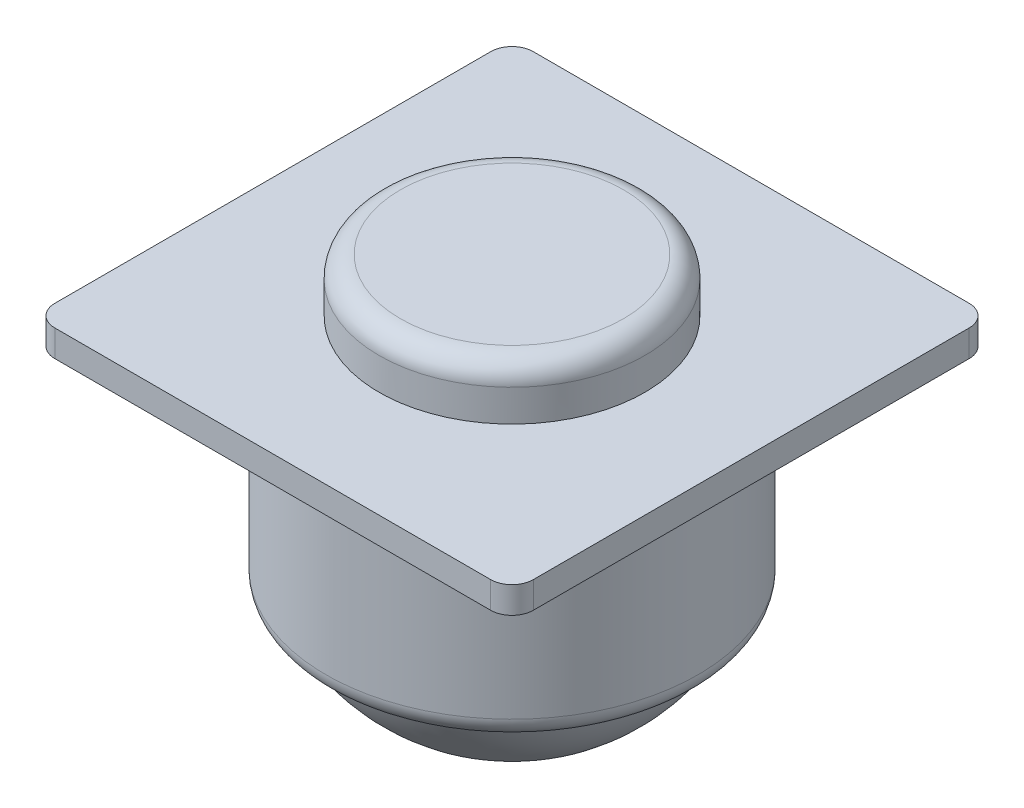
ISO-10303-21;
HEADER;
FILE_DESCRIPTION(('STEP AP214'),'2;1');
FILE_NAME('part.step','',(''),(''),'','','');
FILE_SCHEMA(('AUTOMOTIVE_DESIGN { 1 0 10303 214 1 1 1 1 }'));
ENDSEC;
DATA;
#1=APPLICATION_CONTEXT('core data for automotive mechanical design processes');
#2=APPLICATION_PROTOCOL_DEFINITION('international standard','automotive_design',2000,#1);
#3=PRODUCT_CONTEXT('',#1,'mechanical');
#4=PRODUCT('Part','Part','',(#3));
#5=PRODUCT_RELATED_PRODUCT_CATEGORY('part','',(#4));
#6=PRODUCT_DEFINITION_FORMATION('','',#4);
#7=PRODUCT_DEFINITION_CONTEXT('part definition',#1,'design');
#8=PRODUCT_DEFINITION('design','',#6,#7);
#9=PRODUCT_DEFINITION_SHAPE('','',#8);
#10=(LENGTH_UNIT() NAMED_UNIT(*) SI_UNIT(.MILLI.,.METRE.));
#11=(NAMED_UNIT(*) PLANE_ANGLE_UNIT() SI_UNIT($,.RADIAN.));
#12=(NAMED_UNIT(*) SI_UNIT($,.STERADIAN.) SOLID_ANGLE_UNIT());
#13=UNCERTAINTY_MEASURE_WITH_UNIT(LENGTH_MEASURE(1.E-05),#10,'distance_accuracy_value','');
#14=(GEOMETRIC_REPRESENTATION_CONTEXT(3) GLOBAL_UNCERTAINTY_ASSIGNED_CONTEXT((#13)) GLOBAL_UNIT_ASSIGNED_CONTEXT((#10,
#11,#12)) REPRESENTATION_CONTEXT('',''));
#15=CARTESIAN_POINT('',(0.,0.,0.));
#16=DIRECTION('',(0.,0.,1.));
#17=DIRECTION('',(1.,0.,0.));
#18=AXIS2_PLACEMENT_3D('',#15,#16,#17);
#19=CARTESIAN_POINT('',(14.2875,0.,-14.2875));
#20=DIRECTION('',(0.,-1.,0.));
#21=DIRECTION('',(0.,0.,-1.));
#22=AXIS2_PLACEMENT_3D('',#19,#20,#21);
#23=PLANE('',#22);
#24=DIRECTION('',(0.,0.,1.));
#25=VECTOR('',#24,1.);
#26=CARTESIAN_POINT('',(-14.2875,0.,14.2875));
#27=LINE('',#26,#25);
#28=CARTESIAN_POINT('',(-14.2875,0.,-13.0175));
#29=VERTEX_POINT('',#28);
#30=CARTESIAN_POINT('',(-14.2875,0.,13.0175));
#31=VERTEX_POINT('',#30);
#32=EDGE_CURVE('E115',#29,#31,#27,.T.);
#33=ORIENTED_EDGE('',*,*,#32,.F.);
#34=CARTESIAN_POINT('',(-13.0175,0.,-13.0175));
#35=DIRECTION('',(0.,-1.,0.));
#36=DIRECTION('',(0.,0.,-1.));
#37=AXIS2_PLACEMENT_3D('',#34,#35,#36);
#38=CIRCLE('',#37,1.27);
#39=CARTESIAN_POINT('',(-13.0175,0.,-14.2875));
#40=VERTEX_POINT('',#39);
#41=EDGE_CURVE('E98',#29,#40,#38,.T.);
#42=ORIENTED_EDGE('',*,*,#41,.T.);
#43=DIRECTION('',(-1.,0.,0.));
#44=VECTOR('',#43,1.);
#45=CARTESIAN_POINT('',(-14.2875,0.,-14.2875));
#46=LINE('',#45,#44);
#47=CARTESIAN_POINT('',(13.0175,0.,-14.2875));
#48=VERTEX_POINT('',#47);
#49=EDGE_CURVE('E124',#48,#40,#46,.T.);
#50=ORIENTED_EDGE('',*,*,#49,.F.);
#51=CARTESIAN_POINT('',(13.0175,0.,-13.0175));
#52=DIRECTION('',(0.,-1.,0.));
#53=DIRECTION('',(0.,0.,-1.));
#54=AXIS2_PLACEMENT_3D('',#51,#52,#53);
#55=CIRCLE('',#54,1.27);
#56=CARTESIAN_POINT('',(14.2875,0.,-13.0175));
#57=VERTEX_POINT('',#56);
#58=EDGE_CURVE('E109',#48,#57,#55,.T.);
#59=ORIENTED_EDGE('',*,*,#58,.T.);
#60=DIRECTION('',(0.,0.,-1.));
#61=VECTOR('',#60,1.);
#62=CARTESIAN_POINT('',(14.2875,0.,14.2875));
#63=LINE('',#62,#61);
#64=CARTESIAN_POINT('',(14.2875,0.,13.0175));
#65=VERTEX_POINT('',#64);
#66=EDGE_CURVE('E128',#65,#57,#63,.T.);
#67=ORIENTED_EDGE('',*,*,#66,.F.);
#68=CARTESIAN_POINT('',(13.0175,0.,13.0175));
#69=DIRECTION('',(0.,-1.,0.));
#70=DIRECTION('',(0.,0.,-1.));
#71=AXIS2_PLACEMENT_3D('',#68,#69,#70);
#72=CIRCLE('',#71,1.27);
#73=CARTESIAN_POINT('',(13.0175,0.,14.2875));
#74=VERTEX_POINT('',#73);
#75=EDGE_CURVE('E150',#65,#74,#72,.T.);
#76=ORIENTED_EDGE('',*,*,#75,.T.);
#77=DIRECTION('',(1.,0.,0.));
#78=VECTOR('',#77,1.);
#79=CARTESIAN_POINT('',(-14.2875,0.,14.2875));
#80=LINE('',#79,#78);
#81=CARTESIAN_POINT('',(-13.0175,0.,14.2875));
#82=VERTEX_POINT('',#81);
#83=EDGE_CURVE('E123',#82,#74,#80,.T.);
#84=ORIENTED_EDGE('',*,*,#83,.F.);
#85=CARTESIAN_POINT('',(-13.0175,0.,13.0175));
#86=DIRECTION('',(0.,-1.,0.));
#87=DIRECTION('',(0.,0.,-1.));
#88=AXIS2_PLACEMENT_3D('',#85,#86,#87);
#89=CIRCLE('',#88,1.27);
#90=EDGE_CURVE('E118',#82,#31,#89,.T.);
#91=ORIENTED_EDGE('',*,*,#90,.T.);
#92=EDGE_LOOP('',(#33,#42,#50,#59,#67,#76,#84,#91));
#93=FACE_BOUND('',#92,.T.);
#94=CARTESIAN_POINT('',(0.,0.,0.));
#95=DIRECTION('',(0.,-1.,0.));
#96=DIRECTION('',(0.,0.,-1.));
#97=AXIS2_PLACEMENT_3D('',#94,#95,#96);
#98=CIRCLE('',#97,11.1125);
#99=CARTESIAN_POINT('',(0.,0.,-11.1125));
#100=VERTEX_POINT('',#99);
#101=EDGE_CURVE('E188',#100,#100,#98,.T.);
#102=ORIENTED_EDGE('',*,*,#101,.F.);
#103=EDGE_LOOP('',(#102));
#104=FACE_BOUND('',#103,.T.);
#105=ADVANCED_FACE('F33',(#93,#104),#23,.T.);
#106=CARTESIAN_POINT('',(14.2875,1.5875,-14.2875));
#107=DIRECTION('',(0.,-1.,0.));
#108=DIRECTION('',(0.,0.,-1.));
#109=AXIS2_PLACEMENT_3D('',#106,#107,#108);
#110=PLANE('',#109);
#111=DIRECTION('',(-1.,0.,0.));
#112=VECTOR('',#111,1.);
#113=CARTESIAN_POINT('',(-14.2875,1.5875,-14.2875));
#114=LINE('',#113,#112);
#115=CARTESIAN_POINT('',(13.0175,1.5875,-14.2875));
#116=VERTEX_POINT('',#115);
#117=CARTESIAN_POINT('',(-13.0175,1.5875,-14.2875));
#118=VERTEX_POINT('',#117);
#119=EDGE_CURVE('E183',#116,#118,#114,.T.);
#120=ORIENTED_EDGE('',*,*,#119,.T.);
#121=CARTESIAN_POINT('',(-13.0175,1.5875,-13.0175));
#122=DIRECTION('',(0.,-1.,0.));
#123=DIRECTION('',(0.,0.,-1.));
#124=AXIS2_PLACEMENT_3D('',#121,#122,#123);
#125=CIRCLE('',#124,1.27);
#126=CARTESIAN_POINT('',(-14.2875,1.5875,-13.0175));
#127=VERTEX_POINT('',#126);
#128=EDGE_CURVE('E161',#118,#127,#125,.F.);
#129=ORIENTED_EDGE('',*,*,#128,.T.);
#130=DIRECTION('',(0.,0.,1.));
#131=VECTOR('',#130,1.);
#132=CARTESIAN_POINT('',(-14.2875,1.5875,14.2875));
#133=LINE('',#132,#131);
#134=CARTESIAN_POINT('',(-14.2875,1.5875,13.0175));
#135=VERTEX_POINT('',#134);
#136=EDGE_CURVE('E117',#127,#135,#133,.T.);
#137=ORIENTED_EDGE('',*,*,#136,.T.);
#138=CARTESIAN_POINT('',(-13.0175,1.5875,13.0175));
#139=DIRECTION('',(0.,-1.,0.));
#140=DIRECTION('',(0.,0.,-1.));
#141=AXIS2_PLACEMENT_3D('',#138,#139,#140);
#142=CIRCLE('',#141,1.27);
#143=CARTESIAN_POINT('',(-13.0175,1.5875,14.2875));
#144=VERTEX_POINT('',#143);
#145=EDGE_CURVE('E53',#135,#144,#142,.F.);
#146=ORIENTED_EDGE('',*,*,#145,.T.);
#147=DIRECTION('',(1.,0.,0.));
#148=VECTOR('',#147,1.);
#149=CARTESIAN_POINT('',(-14.2875,1.5875,14.2875));
#150=LINE('',#149,#148);
#151=CARTESIAN_POINT('',(13.0175,1.5875,14.2875));
#152=VERTEX_POINT('',#151);
#153=EDGE_CURVE('E136',#144,#152,#150,.T.);
#154=ORIENTED_EDGE('',*,*,#153,.T.);
#155=CARTESIAN_POINT('',(13.0175,1.5875,13.0175));
#156=DIRECTION('',(0.,-1.,0.));
#157=DIRECTION('',(0.,0.,-1.));
#158=AXIS2_PLACEMENT_3D('',#155,#156,#157);
#159=CIRCLE('',#158,1.27);
#160=CARTESIAN_POINT('',(14.2875,1.5875,13.0175));
#161=VERTEX_POINT('',#160);
#162=EDGE_CURVE('E157',#152,#161,#159,.F.);
#163=ORIENTED_EDGE('',*,*,#162,.T.);
#164=DIRECTION('',(0.,0.,-1.));
#165=VECTOR('',#164,1.);
#166=CARTESIAN_POINT('',(14.2875,1.5875,14.2875));
#167=LINE('',#166,#165);
#168=CARTESIAN_POINT('',(14.2875,1.5875,-13.0175));
#169=VERTEX_POINT('',#168);
#170=EDGE_CURVE('E126',#161,#169,#167,.T.);
#171=ORIENTED_EDGE('',*,*,#170,.T.);
#172=CARTESIAN_POINT('',(13.0175,1.5875,-13.0175));
#173=DIRECTION('',(0.,-1.,0.));
#174=DIRECTION('',(0.,0.,-1.));
#175=AXIS2_PLACEMENT_3D('',#172,#173,#174);
#176=CIRCLE('',#175,1.27);
#177=EDGE_CURVE('E159',#169,#116,#176,.F.);
#178=ORIENTED_EDGE('',*,*,#177,.T.);
#179=EDGE_LOOP('',(#120,#129,#137,#146,#154,#163,#171,#178));
#180=FACE_BOUND('',#179,.T.);
#181=CARTESIAN_POINT('',(0.,1.5875,0.));
#182=DIRECTION('',(0.,-1.,0.));
#183=DIRECTION('',(0.,0.,-1.));
#184=AXIS2_PLACEMENT_3D('',#181,#182,#183);
#185=CIRCLE('',#184,7.9375);
#186=CARTESIAN_POINT('',(0.,1.5875,-7.9375));
#187=VERTEX_POINT('',#186);
#188=EDGE_CURVE('E132',#187,#187,#185,.F.);
#189=ORIENTED_EDGE('',*,*,#188,.F.);
#190=EDGE_LOOP('',(#189));
#191=FACE_BOUND('',#190,.T.);
#192=ADVANCED_FACE('F196',(#180,#191),#110,.F.);
#193=CARTESIAN_POINT('',(14.2875,1.5875,14.2875));
#194=DIRECTION('',(-1.,0.,0.));
#195=DIRECTION('',(0.,0.,1.));
#196=AXIS2_PLACEMENT_3D('',#193,#194,#195);
#197=PLANE('',#196);
#198=ORIENTED_EDGE('',*,*,#66,.T.);
#199=DIRECTION('',(0.,-1.,0.));
#200=VECTOR('',#199,1.);
#201=CARTESIAN_POINT('',(14.2875,1.5875,-13.0175));
#202=LINE('',#201,#200);
#203=EDGE_CURVE('E166',#57,#169,#202,.F.);
#204=ORIENTED_EDGE('',*,*,#203,.T.);
#205=ORIENTED_EDGE('',*,*,#170,.F.);
#206=DIRECTION('',(0.,-1.,0.));
#207=VECTOR('',#206,1.);
#208=CARTESIAN_POINT('',(14.2875,1.5875,13.0175));
#209=LINE('',#208,#207);
#210=EDGE_CURVE('E163',#161,#65,#209,.T.);
#211=ORIENTED_EDGE('',*,*,#210,.T.);
#212=EDGE_LOOP('',(#198,#204,#205,#211));
#213=FACE_BOUND('',#212,.T.);
#214=ADVANCED_FACE('F179',(#213),#197,.F.);
#215=CARTESIAN_POINT('',(-14.2875,1.5875,-14.2875));
#216=DIRECTION('',(0.,0.,1.));
#217=DIRECTION('',(1.,0.,0.));
#218=AXIS2_PLACEMENT_3D('',#215,#216,#217);
#219=PLANE('',#218);
#220=ORIENTED_EDGE('',*,*,#49,.T.);
#221=DIRECTION('',(0.,-1.,0.));
#222=VECTOR('',#221,1.);
#223=CARTESIAN_POINT('',(-13.0175,1.5875,-14.2875));
#224=LINE('',#223,#222);
#225=EDGE_CURVE('E103',#40,#118,#224,.F.);
#226=ORIENTED_EDGE('',*,*,#225,.T.);
#227=ORIENTED_EDGE('',*,*,#119,.F.);
#228=DIRECTION('',(0.,-1.,0.));
#229=VECTOR('',#228,1.);
#230=CARTESIAN_POINT('',(13.0175,1.5875,-14.2875));
#231=LINE('',#230,#229);
#232=EDGE_CURVE('E108',#116,#48,#231,.T.);
#233=ORIENTED_EDGE('',*,*,#232,.T.);
#234=EDGE_LOOP('',(#220,#226,#227,#233));
#235=FACE_BOUND('',#234,.T.);
#236=ADVANCED_FACE('F209',(#235),#219,.F.);
#237=CARTESIAN_POINT('',(-14.2875,1.5875,14.2875));
#238=DIRECTION('',(1.,0.,0.));
#239=DIRECTION('',(0.,0.,-1.));
#240=AXIS2_PLACEMENT_3D('',#237,#238,#239);
#241=PLANE('',#240);
#242=ORIENTED_EDGE('',*,*,#136,.F.);
#243=DIRECTION('',(0.,-1.,0.));
#244=VECTOR('',#243,1.);
#245=CARTESIAN_POINT('',(-14.2875,1.5875,-13.0175));
#246=LINE('',#245,#244);
#247=EDGE_CURVE('E102',#127,#29,#246,.T.);
#248=ORIENTED_EDGE('',*,*,#247,.T.);
#249=ORIENTED_EDGE('',*,*,#32,.T.);
#250=DIRECTION('',(0.,-1.,0.));
#251=VECTOR('',#250,1.);
#252=CARTESIAN_POINT('',(-14.2875,1.5875,13.0175));
#253=LINE('',#252,#251);
#254=EDGE_CURVE('E119',#31,#135,#253,.F.);
#255=ORIENTED_EDGE('',*,*,#254,.T.);
#256=EDGE_LOOP('',(#242,#248,#249,#255));
#257=FACE_BOUND('',#256,.T.);
#258=ADVANCED_FACE('F114',(#257),#241,.F.);
#259=CARTESIAN_POINT('',(-14.2875,1.5875,14.2875));
#260=DIRECTION('',(0.,0.,-1.));
#261=DIRECTION('',(-1.,0.,0.));
#262=AXIS2_PLACEMENT_3D('',#259,#260,#261);
#263=PLANE('',#262);
#264=ORIENTED_EDGE('',*,*,#83,.T.);
#265=DIRECTION('',(0.,-1.,0.));
#266=VECTOR('',#265,1.);
#267=CARTESIAN_POINT('',(13.0175,1.5875,14.2875));
#268=LINE('',#267,#266);
#269=EDGE_CURVE('E11',#74,#152,#268,.F.);
#270=ORIENTED_EDGE('',*,*,#269,.T.);
#271=ORIENTED_EDGE('',*,*,#153,.F.);
#272=DIRECTION('',(0.,-1.,0.));
#273=VECTOR('',#272,1.);
#274=CARTESIAN_POINT('',(-13.0175,1.5875,14.2875));
#275=LINE('',#274,#273);
#276=EDGE_CURVE('E41',#144,#82,#275,.T.);
#277=ORIENTED_EDGE('',*,*,#276,.T.);
#278=EDGE_LOOP('',(#264,#270,#271,#277));
#279=FACE_BOUND('',#278,.T.);
#280=ADVANCED_FACE('F169',(#279),#263,.F.);
#281=CARTESIAN_POINT('',(0.,4.7625,0.));
#282=DIRECTION('',(0.,-1.,0.));
#283=DIRECTION('',(0.,0.,-1.));
#284=AXIS2_PLACEMENT_3D('',#281,#282,#283);
#285=CYLINDRICAL_SURFACE('',#284,7.9375);
#286=CARTESIAN_POINT('',(0.,3.4925,0.));
#287=DIRECTION('',(0.,1.,0.));
#288=DIRECTION('',(0.,0.,1.));
#289=AXIS2_PLACEMENT_3D('',#286,#287,#288);
#290=CIRCLE('',#289,7.9375);
#291=CARTESIAN_POINT('',(0.,3.4925,7.9375));
#292=VERTEX_POINT('',#291);
#293=EDGE_CURVE('E143',#292,#292,#290,.F.);
#294=ORIENTED_EDGE('',*,*,#293,.T.);
#295=EDGE_LOOP('',(#294));
#296=FACE_BOUND('',#295,.T.);
#297=ORIENTED_EDGE('',*,*,#188,.T.);
#298=EDGE_LOOP('',(#297));
#299=FACE_BOUND('',#298,.T.);
#300=ADVANCED_FACE('F206',(#296,#299),#285,.T.);
#301=CARTESIAN_POINT('',(0.,4.7625,0.));
#302=DIRECTION('',(0.,1.,0.));
#303=DIRECTION('',(0.,0.,1.));
#304=AXIS2_PLACEMENT_3D('',#301,#302,#303);
#305=PLANE('',#304);
#306=CARTESIAN_POINT('',(0.,4.7625,0.));
#307=DIRECTION('',(0.,1.,0.));
#308=DIRECTION('',(0.,0.,1.));
#309=AXIS2_PLACEMENT_3D('',#306,#307,#308);
#310=CIRCLE('',#309,6.6675);
#311=CARTESIAN_POINT('',(0.,4.7625,6.6675));
#312=VERTEX_POINT('',#311);
#313=EDGE_CURVE('E140',#312,#312,#310,.T.);
#314=ORIENTED_EDGE('',*,*,#313,.T.);
#315=EDGE_LOOP('',(#314));
#316=FACE_BOUND('',#315,.T.);
#317=ADVANCED_FACE('F244',(#316),#305,.T.);
#318=CARTESIAN_POINT('',(0.,-12.7,0.));
#319=DIRECTION('',(0.,1.,0.));
#320=DIRECTION('',(0.,0.,1.));
#321=AXIS2_PLACEMENT_3D('',#318,#319,#320);
#322=CYLINDRICAL_SURFACE('',#321,11.1125);
#323=CARTESIAN_POINT('',(0.,-11.43,0.));
#324=DIRECTION('',(0.,-1.,0.));
#325=DIRECTION('',(0.,0.,-1.));
#326=AXIS2_PLACEMENT_3D('',#323,#324,#325);
#327=CIRCLE('',#326,11.1125);
#328=CARTESIAN_POINT('',(0.,-11.43,-11.1125));
#329=VERTEX_POINT('',#328);
#330=EDGE_CURVE('E137',#329,#329,#327,.F.);
#331=ORIENTED_EDGE('',*,*,#330,.T.);
#332=EDGE_LOOP('',(#331));
#333=FACE_BOUND('',#332,.T.);
#334=ORIENTED_EDGE('',*,*,#101,.T.);
#335=EDGE_LOOP('',(#334));
#336=FACE_BOUND('',#335,.T.);
#337=ADVANCED_FACE('F194',(#333,#336),#322,.T.);
#338=CARTESIAN_POINT('',(0.,-8.2470625,0.));
#339=DIRECTION('',(0.,0.,1.));
#340=DIRECTION('',(1.,0.,0.));
#341=AXIS2_PLACEMENT_3D('',#338,#339,#340);
#342=SPHERICAL_SURFACE('',#341,10.8029375);
#343=CARTESIAN_POINT('',(0.,-8.2470625,0.));
#344=DIRECTION('',(0.,-1.,0.));
#345=DIRECTION('',(0.,0.,-1.));
#346=AXIS2_PLACEMENT_3D('',#343,#344,#345);
#347=SPHERICAL_SURFACE('',#346,10.8029375);
#348=CARTESIAN_POINT('',(0.,-12.7,0.));
#349=DIRECTION('',(0.,-1.,0.));
#350=DIRECTION('',(0.,0.,-1.));
#351=AXIS2_PLACEMENT_3D('',#348,#349,#350);
#352=CIRCLE('',#351,9.8425);
#353=CARTESIAN_POINT('',(0.,-12.7,-9.8425));
#354=VERTEX_POINT('',#353);
#355=EDGE_CURVE('E135',#354,#354,#352,.T.);
#356=ORIENTED_EDGE('',*,*,#355,.T.);
#357=EDGE_LOOP('',(#356));
#358=FACE_BOUND('',#357,.T.);
#359=ADVANCED_FACE('F219',(#358),#347,.T.);
#360=CARTESIAN_POINT('',(0.,-11.43,0.));
#361=DIRECTION('',(0.,-1.,0.));
#362=DIRECTION('',(0.,0.,-1.));
#363=AXIS2_PLACEMENT_3D('',#360,#361,#362);
#364=TOROIDAL_SURFACE('',#363,9.8425,1.27);
#365=ORIENTED_EDGE('',*,*,#330,.F.);
#366=EDGE_LOOP('',(#365));
#367=FACE_BOUND('',#366,.T.);
#368=ORIENTED_EDGE('',*,*,#355,.F.);
#369=EDGE_LOOP('',(#368));
#370=FACE_BOUND('',#369,.T.);
#371=ADVANCED_FACE('F215',(#367,#370),#364,.T.);
#372=CARTESIAN_POINT('',(0.,3.4925,0.));
#373=DIRECTION('',(0.,1.,0.));
#374=DIRECTION('',(0.,0.,1.));
#375=AXIS2_PLACEMENT_3D('',#372,#373,#374);
#376=TOROIDAL_SURFACE('',#375,6.6675,1.27);
#377=ORIENTED_EDGE('',*,*,#293,.F.);
#378=EDGE_LOOP('',(#377));
#379=FACE_BOUND('',#378,.T.);
#380=ORIENTED_EDGE('',*,*,#313,.F.);
#381=EDGE_LOOP('',(#380));
#382=FACE_BOUND('',#381,.T.);
#383=ADVANCED_FACE('F218',(#379,#382),#376,.T.);
#384=CARTESIAN_POINT('',(-13.0175,1.5875,-13.0175));
#385=DIRECTION('',(0.,-1.,0.));
#386=DIRECTION('',(0.,0.,-1.));
#387=AXIS2_PLACEMENT_3D('',#384,#385,#386);
#388=CYLINDRICAL_SURFACE('',#387,1.27);
#389=ORIENTED_EDGE('',*,*,#128,.F.);
#390=ORIENTED_EDGE('',*,*,#225,.F.);
#391=ORIENTED_EDGE('',*,*,#41,.F.);
#392=ORIENTED_EDGE('',*,*,#247,.F.);
#393=EDGE_LOOP('',(#389,#390,#391,#392));
#394=FACE_BOUND('',#393,.T.);
#395=ADVANCED_FACE('F101',(#394),#388,.T.);
#396=CARTESIAN_POINT('',(13.0175,1.5875,-13.0175));
#397=DIRECTION('',(0.,-1.,0.));
#398=DIRECTION('',(0.,0.,-1.));
#399=AXIS2_PLACEMENT_3D('',#396,#397,#398);
#400=CYLINDRICAL_SURFACE('',#399,1.27);
#401=ORIENTED_EDGE('',*,*,#177,.F.);
#402=ORIENTED_EDGE('',*,*,#203,.F.);
#403=ORIENTED_EDGE('',*,*,#58,.F.);
#404=ORIENTED_EDGE('',*,*,#232,.F.);
#405=EDGE_LOOP('',(#401,#402,#403,#404));
#406=FACE_BOUND('',#405,.T.);
#407=ADVANCED_FACE('F229',(#406),#400,.T.);
#408=CARTESIAN_POINT('',(13.0175,1.5875,13.0175));
#409=DIRECTION('',(0.,-1.,0.));
#410=DIRECTION('',(0.,0.,-1.));
#411=AXIS2_PLACEMENT_3D('',#408,#409,#410);
#412=CYLINDRICAL_SURFACE('',#411,1.27);
#413=ORIENTED_EDGE('',*,*,#162,.F.);
#414=ORIENTED_EDGE('',*,*,#269,.F.);
#415=ORIENTED_EDGE('',*,*,#75,.F.);
#416=ORIENTED_EDGE('',*,*,#210,.F.);
#417=EDGE_LOOP('',(#413,#414,#415,#416));
#418=FACE_BOUND('',#417,.T.);
#419=ADVANCED_FACE('F176',(#418),#412,.T.);
#420=CARTESIAN_POINT('',(-13.0175,1.5875,13.0175));
#421=DIRECTION('',(0.,-1.,0.));
#422=DIRECTION('',(0.,0.,-1.));
#423=AXIS2_PLACEMENT_3D('',#420,#421,#422);
#424=CYLINDRICAL_SURFACE('',#423,1.27);
#425=ORIENTED_EDGE('',*,*,#145,.F.);
#426=ORIENTED_EDGE('',*,*,#254,.F.);
#427=ORIENTED_EDGE('',*,*,#90,.F.);
#428=ORIENTED_EDGE('',*,*,#276,.F.);
#429=EDGE_LOOP('',(#425,#426,#427,#428));
#430=FACE_BOUND('',#429,.T.);
#431=ADVANCED_FACE('F35',(#430),#424,.T.);
#432=CLOSED_SHELL('',(#105,#192,#214,#236,#258,#280,#300,#317,#337,#359,#371,#383,#395,#407,
#419,#431));
#433=MANIFOLD_SOLID_BREP('B2',#432);
#434=ADVANCED_BREP_SHAPE_REPRESENTATION('',(#18,#433),#14);
#435=SHAPE_DEFINITION_REPRESENTATION(#9,#434);
ENDSEC;
END-ISO-10303-21;
